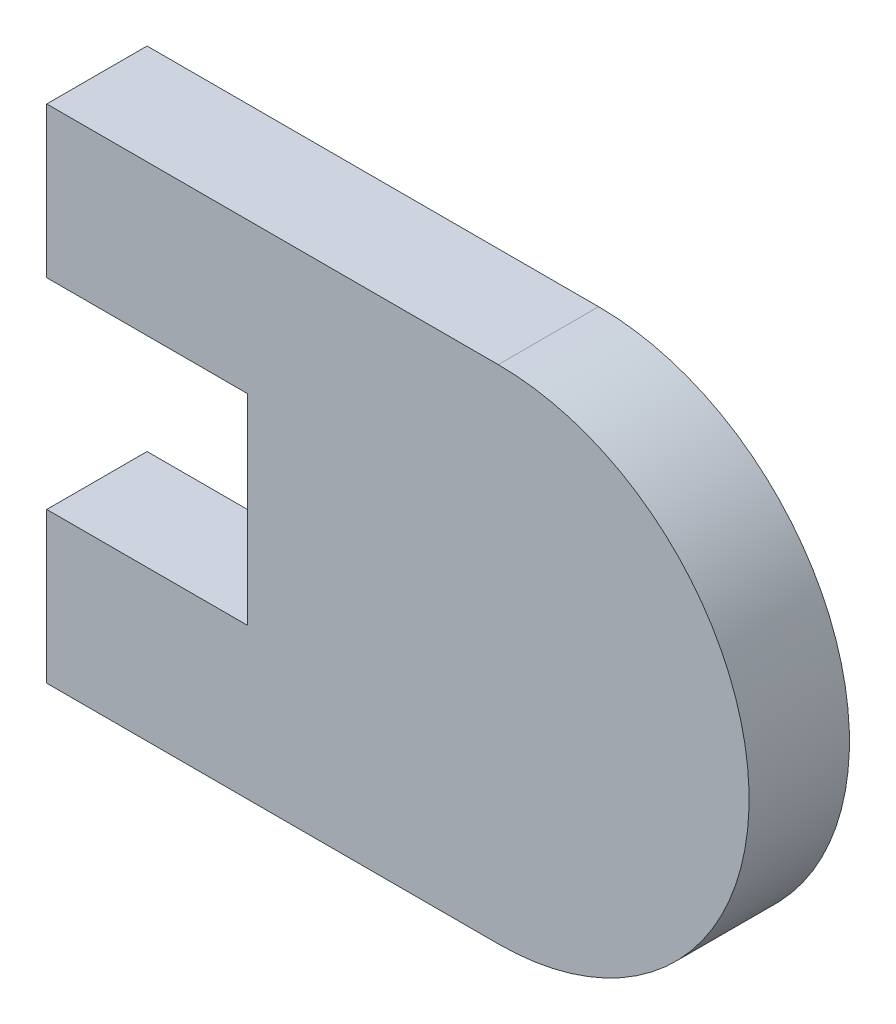
ISO-10303-21;
HEADER;
FILE_DESCRIPTION(('STEP AP214'),'2;1');
FILE_NAME('part.step','',(''),(''),'','','');
FILE_SCHEMA(('AUTOMOTIVE_DESIGN { 1 0 10303 214 1 1 1 1 }'));
ENDSEC;
DATA;
#1=APPLICATION_CONTEXT('core data for automotive mechanical design processes');
#2=APPLICATION_PROTOCOL_DEFINITION('international standard','automotive_design',2000,#1);
#3=PRODUCT_CONTEXT('',#1,'mechanical');
#4=PRODUCT('Part','Part','',(#3));
#5=PRODUCT_RELATED_PRODUCT_CATEGORY('part','',(#4));
#6=PRODUCT_DEFINITION_FORMATION('','',#4);
#7=PRODUCT_DEFINITION_CONTEXT('part definition',#1,'design');
#8=PRODUCT_DEFINITION('design','',#6,#7);
#9=PRODUCT_DEFINITION_SHAPE('','',#8);
#10=(LENGTH_UNIT() NAMED_UNIT(*) SI_UNIT(.MILLI.,.METRE.));
#11=(NAMED_UNIT(*) PLANE_ANGLE_UNIT() SI_UNIT($,.RADIAN.));
#12=(NAMED_UNIT(*) SI_UNIT($,.STERADIAN.) SOLID_ANGLE_UNIT());
#13=UNCERTAINTY_MEASURE_WITH_UNIT(LENGTH_MEASURE(1.E-05),#10,'distance_accuracy_value','');
#14=(GEOMETRIC_REPRESENTATION_CONTEXT(3) GLOBAL_UNCERTAINTY_ASSIGNED_CONTEXT((#13)) GLOBAL_UNIT_ASSIGNED_CONTEXT((#10,
#11,#12)) REPRESENTATION_CONTEXT('',''));
#15=CARTESIAN_POINT('',(0.,0.,0.));
#16=DIRECTION('',(0.,0.,1.));
#17=DIRECTION('',(1.,0.,0.));
#18=AXIS2_PLACEMENT_3D('',#15,#16,#17);
#19=CARTESIAN_POINT('',(0.,0.,3.175));
#20=DIRECTION('',(1.,0.,0.));
#21=DIRECTION('',(0.,0.,-1.));
#22=AXIS2_PLACEMENT_3D('',#19,#20,#21);
#23=PLANE('',#22);
#24=DIRECTION('',(0.,-1.,0.));
#25=VECTOR('',#24,1.);
#26=CARTESIAN_POINT('',(0.,0.,0.));
#27=LINE('',#26,#25);
#28=CARTESIAN_POINT('',(0.,4.7625,0.));
#29=VERTEX_POINT('',#28);
#30=CARTESIAN_POINT('',(0.,0.,0.));
#31=VERTEX_POINT('',#30);
#32=EDGE_CURVE('E129',#29,#31,#27,.T.);
#33=ORIENTED_EDGE('',*,*,#32,.T.);
#34=DIRECTION('',(0.,0.,-1.));
#35=VECTOR('',#34,1.);
#36=CARTESIAN_POINT('',(0.,0.,3.175));
#37=LINE('',#36,#35);
#38=CARTESIAN_POINT('',(0.,0.,3.175));
#39=VERTEX_POINT('',#38);
#40=EDGE_CURVE('E11',#39,#31,#37,.T.);
#41=ORIENTED_EDGE('',*,*,#40,.F.);
#42=DIRECTION('',(0.,-1.,0.));
#43=VECTOR('',#42,1.);
#44=CARTESIAN_POINT('',(0.,0.,3.175));
#45=LINE('',#44,#43);
#46=CARTESIAN_POINT('',(0.,4.7625,3.175));
#47=VERTEX_POINT('',#46);
#48=EDGE_CURVE('E143',#47,#39,#45,.T.);
#49=ORIENTED_EDGE('',*,*,#48,.F.);
#50=DIRECTION('',(0.,0.,-1.));
#51=VECTOR('',#50,1.);
#52=CARTESIAN_POINT('',(0.,4.7625,3.175));
#53=LINE('',#52,#51);
#54=EDGE_CURVE('E125',#47,#29,#53,.T.);
#55=ORIENTED_EDGE('',*,*,#54,.T.);
#56=EDGE_LOOP('',(#33,#41,#49,#55));
#57=FACE_BOUND('',#56,.T.);
#58=ADVANCED_FACE('F33',(#57),#23,.F.);
#59=CARTESIAN_POINT('',(0.,0.,3.175));
#60=DIRECTION('',(0.,1.,0.));
#61=DIRECTION('',(0.,0.,1.));
#62=AXIS2_PLACEMENT_3D('',#59,#60,#61);
#63=PLANE('',#62);
#64=DIRECTION('',(1.,0.,0.));
#65=VECTOR('',#64,1.);
#66=CARTESIAN_POINT('',(0.,0.,0.));
#67=LINE('',#66,#65);
#68=CARTESIAN_POINT('',(14.2875,0.,0.));
#69=VERTEX_POINT('',#68);
#70=EDGE_CURVE('E132',#31,#69,#67,.T.);
#71=ORIENTED_EDGE('',*,*,#70,.T.);
#72=DIRECTION('',(0.,0.,-1.));
#73=VECTOR('',#72,1.);
#74=CARTESIAN_POINT('',(14.2875,0.,3.175));
#75=LINE('',#74,#73);
#76=CARTESIAN_POINT('',(14.2875,0.,3.175));
#77=VERTEX_POINT('',#76);
#78=EDGE_CURVE('E41',#77,#69,#75,.T.);
#79=ORIENTED_EDGE('',*,*,#78,.F.);
#80=DIRECTION('',(1.,0.,0.));
#81=VECTOR('',#80,1.);
#82=CARTESIAN_POINT('',(0.,0.,3.175));
#83=LINE('',#82,#81);
#84=EDGE_CURVE('E92',#39,#77,#83,.T.);
#85=ORIENTED_EDGE('',*,*,#84,.F.);
#86=ORIENTED_EDGE('',*,*,#40,.T.);
#87=EDGE_LOOP('',(#71,#79,#85,#86));
#88=FACE_BOUND('',#87,.T.);
#89=ADVANCED_FACE('F178',(#88),#63,.F.);
#90=CARTESIAN_POINT('',(14.2875,7.9375,3.175));
#91=DIRECTION('',(0.,0.,-1.));
#92=DIRECTION('',(-1.,0.,0.));
#93=AXIS2_PLACEMENT_3D('',#90,#91,#92);
#94=CYLINDRICAL_SURFACE('',#93,7.9375);
#95=CARTESIAN_POINT('',(14.2875,7.9375,0.));
#96=DIRECTION('',(0.,0.,1.));
#97=DIRECTION('',(1.,0.,0.));
#98=AXIS2_PLACEMENT_3D('',#95,#96,#97);
#99=CIRCLE('',#98,7.9375);
#100=CARTESIAN_POINT('',(14.2875,15.875,0.));
#101=VERTEX_POINT('',#100);
#102=EDGE_CURVE('E134',#69,#101,#99,.T.);
#103=ORIENTED_EDGE('',*,*,#102,.T.);
#104=DIRECTION('',(0.,0.,-1.));
#105=VECTOR('',#104,1.);
#106=CARTESIAN_POINT('',(14.2875,15.875,3.175));
#107=LINE('',#106,#105);
#108=CARTESIAN_POINT('',(14.2875,15.875,3.175));
#109=VERTEX_POINT('',#108);
#110=EDGE_CURVE('E150',#109,#101,#107,.T.);
#111=ORIENTED_EDGE('',*,*,#110,.F.);
#112=CARTESIAN_POINT('',(14.2875,7.9375,3.175));
#113=DIRECTION('',(0.,0.,1.));
#114=DIRECTION('',(1.,0.,0.));
#115=AXIS2_PLACEMENT_3D('',#112,#113,#114);
#116=CIRCLE('',#115,7.9375);
#117=EDGE_CURVE('E158',#77,#109,#116,.T.);
#118=ORIENTED_EDGE('',*,*,#117,.F.);
#119=ORIENTED_EDGE('',*,*,#78,.T.);
#120=EDGE_LOOP('',(#103,#111,#118,#119));
#121=FACE_BOUND('',#120,.T.);
#122=ADVANCED_FACE('F156',(#121),#94,.T.);
#123=CARTESIAN_POINT('',(0.,15.875,3.175));
#124=DIRECTION('',(0.,-1.,0.));
#125=DIRECTION('',(0.,0.,-1.));
#126=AXIS2_PLACEMENT_3D('',#123,#124,#125);
#127=PLANE('',#126);
#128=DIRECTION('',(-1.,0.,0.));
#129=VECTOR('',#128,1.);
#130=CARTESIAN_POINT('',(0.,15.875,0.));
#131=LINE('',#130,#129);
#132=CARTESIAN_POINT('',(0.,15.875,0.));
#133=VERTEX_POINT('',#132);
#134=EDGE_CURVE('E136',#101,#133,#131,.T.);
#135=ORIENTED_EDGE('',*,*,#134,.T.);
#136=DIRECTION('',(0.,0.,-1.));
#137=VECTOR('',#136,1.);
#138=CARTESIAN_POINT('',(0.,15.875,3.175));
#139=LINE('',#138,#137);
#140=CARTESIAN_POINT('',(0.,15.875,3.175));
#141=VERTEX_POINT('',#140);
#142=EDGE_CURVE('E147',#141,#133,#139,.T.);
#143=ORIENTED_EDGE('',*,*,#142,.F.);
#144=DIRECTION('',(-1.,0.,0.));
#145=VECTOR('',#144,1.);
#146=CARTESIAN_POINT('',(0.,15.875,3.175));
#147=LINE('',#146,#145);
#148=EDGE_CURVE('E170',#109,#141,#147,.T.);
#149=ORIENTED_EDGE('',*,*,#148,.F.);
#150=ORIENTED_EDGE('',*,*,#110,.T.);
#151=EDGE_LOOP('',(#135,#143,#149,#150));
#152=FACE_BOUND('',#151,.T.);
#153=ADVANCED_FACE('F166',(#152),#127,.F.);
#154=CARTESIAN_POINT('',(0.,11.1125,3.175));
#155=DIRECTION('',(1.,0.,0.));
#156=DIRECTION('',(0.,0.,-1.));
#157=AXIS2_PLACEMENT_3D('',#154,#155,#156);
#158=PLANE('',#157);
#159=DIRECTION('',(0.,-1.,0.));
#160=VECTOR('',#159,1.);
#161=CARTESIAN_POINT('',(0.,11.1125,0.));
#162=LINE('',#161,#160);
#163=CARTESIAN_POINT('',(0.,11.1125,0.));
#164=VERTEX_POINT('',#163);
#165=EDGE_CURVE('E138',#133,#164,#162,.T.);
#166=ORIENTED_EDGE('',*,*,#165,.T.);
#167=DIRECTION('',(0.,0.,-1.));
#168=VECTOR('',#167,1.);
#169=CARTESIAN_POINT('',(0.,11.1125,3.175));
#170=LINE('',#169,#168);
#171=CARTESIAN_POINT('',(0.,11.1125,3.175));
#172=VERTEX_POINT('',#171);
#173=EDGE_CURVE('E120',#172,#164,#170,.T.);
#174=ORIENTED_EDGE('',*,*,#173,.F.);
#175=DIRECTION('',(0.,-1.,0.));
#176=VECTOR('',#175,1.);
#177=CARTESIAN_POINT('',(0.,11.1125,3.175));
#178=LINE('',#177,#176);
#179=EDGE_CURVE('E111',#141,#172,#178,.T.);
#180=ORIENTED_EDGE('',*,*,#179,.F.);
#181=ORIENTED_EDGE('',*,*,#142,.T.);
#182=EDGE_LOOP('',(#166,#174,#180,#181));
#183=FACE_BOUND('',#182,.T.);
#184=ADVANCED_FACE('F169',(#183),#158,.F.);
#185=CARTESIAN_POINT('',(0.,11.1125,3.175));
#186=DIRECTION('',(0.,1.,0.));
#187=DIRECTION('',(0.,0.,1.));
#188=AXIS2_PLACEMENT_3D('',#185,#186,#187);
#189=PLANE('',#188);
#190=DIRECTION('',(1.,0.,0.));
#191=VECTOR('',#190,1.);
#192=CARTESIAN_POINT('',(0.,11.1125,0.));
#193=LINE('',#192,#191);
#194=CARTESIAN_POINT('',(6.35,11.1125,0.));
#195=VERTEX_POINT('',#194);
#196=EDGE_CURVE('E119',#164,#195,#193,.T.);
#197=ORIENTED_EDGE('',*,*,#196,.T.);
#198=DIRECTION('',(0.,0.,-1.));
#199=VECTOR('',#198,1.);
#200=CARTESIAN_POINT('',(6.35,11.1125,3.175));
#201=LINE('',#200,#199);
#202=CARTESIAN_POINT('',(6.35,11.1125,3.175));
#203=VERTEX_POINT('',#202);
#204=EDGE_CURVE('E116',#203,#195,#201,.T.);
#205=ORIENTED_EDGE('',*,*,#204,.F.);
#206=DIRECTION('',(1.,0.,0.));
#207=VECTOR('',#206,1.);
#208=CARTESIAN_POINT('',(0.,11.1125,3.175));
#209=LINE('',#208,#207);
#210=EDGE_CURVE('E105',#172,#203,#209,.T.);
#211=ORIENTED_EDGE('',*,*,#210,.F.);
#212=ORIENTED_EDGE('',*,*,#173,.T.);
#213=EDGE_LOOP('',(#197,#205,#211,#212));
#214=FACE_BOUND('',#213,.T.);
#215=ADVANCED_FACE('F117',(#214),#189,.F.);
#216=CARTESIAN_POINT('',(6.35,11.1125,3.175));
#217=DIRECTION('',(1.,0.,0.));
#218=DIRECTION('',(0.,0.,-1.));
#219=AXIS2_PLACEMENT_3D('',#216,#217,#218);
#220=PLANE('',#219);
#221=DIRECTION('',(0.,-1.,0.));
#222=VECTOR('',#221,1.);
#223=CARTESIAN_POINT('',(6.35,11.1125,0.));
#224=LINE('',#223,#222);
#225=CARTESIAN_POINT('',(6.35,4.7625,0.));
#226=VERTEX_POINT('',#225);
#227=EDGE_CURVE('E78',#195,#226,#224,.T.);
#228=ORIENTED_EDGE('',*,*,#227,.T.);
#229=DIRECTION('',(0.,0.,-1.));
#230=VECTOR('',#229,1.);
#231=CARTESIAN_POINT('',(6.35,4.7625,3.175));
#232=LINE('',#231,#230);
#233=CARTESIAN_POINT('',(6.35,4.7625,3.175));
#234=VERTEX_POINT('',#233);
#235=EDGE_CURVE('E121',#234,#226,#232,.T.);
#236=ORIENTED_EDGE('',*,*,#235,.F.);
#237=DIRECTION('',(0.,-1.,0.));
#238=VECTOR('',#237,1.);
#239=CARTESIAN_POINT('',(6.35,11.1125,3.175));
#240=LINE('',#239,#238);
#241=EDGE_CURVE('E109',#203,#234,#240,.T.);
#242=ORIENTED_EDGE('',*,*,#241,.F.);
#243=ORIENTED_EDGE('',*,*,#204,.T.);
#244=EDGE_LOOP('',(#228,#236,#242,#243));
#245=FACE_BOUND('',#244,.T.);
#246=ADVANCED_FACE('F123',(#245),#220,.F.);
#247=CARTESIAN_POINT('',(0.,4.7625,3.175));
#248=DIRECTION('',(0.,-1.,0.));
#249=DIRECTION('',(0.,0.,-1.));
#250=AXIS2_PLACEMENT_3D('',#247,#248,#249);
#251=PLANE('',#250);
#252=DIRECTION('',(-1.,0.,0.));
#253=VECTOR('',#252,1.);
#254=CARTESIAN_POINT('',(0.,4.7625,0.));
#255=LINE('',#254,#253);
#256=EDGE_CURVE('E84',#226,#29,#255,.T.);
#257=ORIENTED_EDGE('',*,*,#256,.T.);
#258=ORIENTED_EDGE('',*,*,#54,.F.);
#259=DIRECTION('',(-1.,0.,0.));
#260=VECTOR('',#259,1.);
#261=CARTESIAN_POINT('',(0.,4.7625,3.175));
#262=LINE('',#261,#260);
#263=EDGE_CURVE('E49',#234,#47,#262,.T.);
#264=ORIENTED_EDGE('',*,*,#263,.F.);
#265=ORIENTED_EDGE('',*,*,#235,.T.);
#266=EDGE_LOOP('',(#257,#258,#264,#265));
#267=FACE_BOUND('',#266,.T.);
#268=ADVANCED_FACE('F194',(#267),#251,.F.);
#269=CARTESIAN_POINT('',(14.2875,7.9375,3.175));
#270=DIRECTION('',(0.,0.,1.));
#271=DIRECTION('',(1.,0.,0.));
#272=AXIS2_PLACEMENT_3D('',#269,#270,#271);
#273=PLANE('',#272);
#274=ORIENTED_EDGE('',*,*,#48,.T.);
#275=ORIENTED_EDGE('',*,*,#84,.T.);
#276=ORIENTED_EDGE('',*,*,#117,.T.);
#277=ORIENTED_EDGE('',*,*,#148,.T.);
#278=ORIENTED_EDGE('',*,*,#179,.T.);
#279=ORIENTED_EDGE('',*,*,#210,.T.);
#280=ORIENTED_EDGE('',*,*,#241,.T.);
#281=ORIENTED_EDGE('',*,*,#263,.T.);
#282=EDGE_LOOP('',(#274,#275,#276,#277,#278,#279,#280,#281));
#283=FACE_BOUND('',#282,.T.);
#284=ADVANCED_FACE('F107',(#283),#273,.T.);
#285=CARTESIAN_POINT('',(14.2875,7.9375,0.));
#286=DIRECTION('',(0.,0.,1.));
#287=DIRECTION('',(1.,0.,0.));
#288=AXIS2_PLACEMENT_3D('',#285,#286,#287);
#289=PLANE('',#288);
#290=ORIENTED_EDGE('',*,*,#32,.F.);
#291=ORIENTED_EDGE('',*,*,#256,.F.);
#292=ORIENTED_EDGE('',*,*,#227,.F.);
#293=ORIENTED_EDGE('',*,*,#196,.F.);
#294=ORIENTED_EDGE('',*,*,#165,.F.);
#295=ORIENTED_EDGE('',*,*,#134,.F.);
#296=ORIENTED_EDGE('',*,*,#102,.F.);
#297=ORIENTED_EDGE('',*,*,#70,.F.);
#298=EDGE_LOOP('',(#290,#291,#292,#293,#294,#295,#296,#297));
#299=FACE_BOUND('',#298,.T.);
#300=ADVANCED_FACE('F162',(#299),#289,.F.);
#301=CLOSED_SHELL('',(#58,#89,#122,#153,#184,#215,#246,#268,#284,#300));
#302=MANIFOLD_SOLID_BREP('B2',#301);
#303=ADVANCED_BREP_SHAPE_REPRESENTATION('',(#18,#302),#14);
#304=SHAPE_DEFINITION_REPRESENTATION(#9,#303);
ENDSEC;
END-ISO-10303-21;
